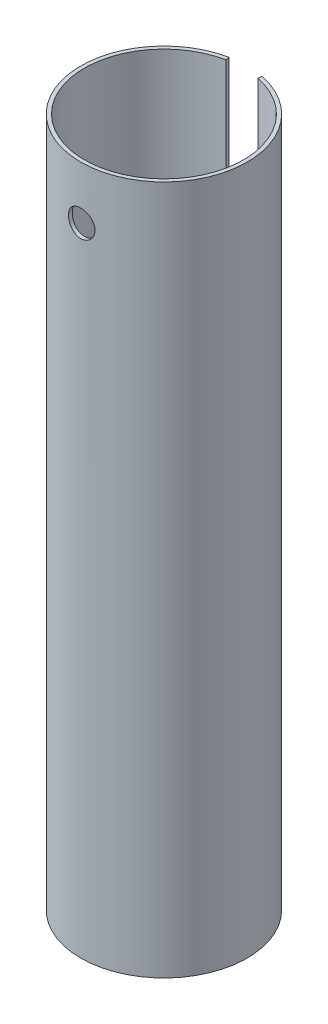
ISO-10303-21;
HEADER;
FILE_DESCRIPTION(('STEP AP214'),'2;1');
FILE_NAME('part.step','',(''),(''),'','','');
FILE_SCHEMA(('AUTOMOTIVE_DESIGN { 1 0 10303 214 1 1 1 1 }'));
ENDSEC;
DATA;
#1=APPLICATION_CONTEXT('core data for automotive mechanical design processes');
#2=APPLICATION_PROTOCOL_DEFINITION('international standard','automotive_design',2000,#1);
#3=PRODUCT_CONTEXT('',#1,'mechanical');
#4=PRODUCT('Part','Part','',(#3));
#5=PRODUCT_RELATED_PRODUCT_CATEGORY('part','',(#4));
#6=PRODUCT_DEFINITION_FORMATION('','',#4);
#7=PRODUCT_DEFINITION_CONTEXT('part definition',#1,'design');
#8=PRODUCT_DEFINITION('design','',#6,#7);
#9=PRODUCT_DEFINITION_SHAPE('','',#8);
#10=(LENGTH_UNIT() NAMED_UNIT(*) SI_UNIT(.MILLI.,.METRE.));
#11=(NAMED_UNIT(*) PLANE_ANGLE_UNIT() SI_UNIT($,.RADIAN.));
#12=(NAMED_UNIT(*) SI_UNIT($,.STERADIAN.) SOLID_ANGLE_UNIT());
#13=UNCERTAINTY_MEASURE_WITH_UNIT(LENGTH_MEASURE(1.E-05),#10,'distance_accuracy_value','');
#14=(GEOMETRIC_REPRESENTATION_CONTEXT(3) GLOBAL_UNCERTAINTY_ASSIGNED_CONTEXT((#13)) GLOBAL_UNIT_ASSIGNED_CONTEXT((#10,
#11,#12)) REPRESENTATION_CONTEXT('',''));
#15=CARTESIAN_POINT('',(0.,0.,0.));
#16=DIRECTION('',(0.,0.,1.));
#17=DIRECTION('',(1.,0.,0.));
#18=AXIS2_PLACEMENT_3D('',#15,#16,#17);
#19=CARTESIAN_POINT('',(0.,13.,0.));
#20=DIRECTION('',(0.,-1.,0.));
#21=DIRECTION('',(0.,0.,-1.));
#22=AXIS2_PLACEMENT_3D('',#19,#20,#21);
#23=CYLINDRICAL_SURFACE('',#22,1.5);
#24=CARTESIAN_POINT('',(0.,0.,0.));
#25=DIRECTION('',(0.,-1.,0.));
#26=DIRECTION('',(0.,0.,-1.));
#27=AXIS2_PLACEMENT_3D('',#24,#25,#26);
#28=CIRCLE('',#27,1.5);
#29=CARTESIAN_POINT('',(0.3,0.,-1.46969384566991));
#30=VERTEX_POINT('',#29);
#31=CARTESIAN_POINT('',(-0.3,0.,-1.46969384566991));
#32=VERTEX_POINT('',#31);
#33=EDGE_CURVE('E103',#30,#32,#28,.T.);
#34=ORIENTED_EDGE('',*,*,#33,.T.);
#35=DIRECTION('',(0.,-1.,0.));
#36=VECTOR('',#35,1.);
#37=CARTESIAN_POINT('',(-0.3,13.,-1.46969384566991));
#38=LINE('',#37,#36);
#39=CARTESIAN_POINT('',(-0.3,13.,-1.46969384566991));
#40=VERTEX_POINT('',#39);
#41=EDGE_CURVE('E44',#40,#32,#38,.T.);
#42=ORIENTED_EDGE('',*,*,#41,.F.);
#43=CARTESIAN_POINT('',(0.,13.,0.));
#44=DIRECTION('',(0.,-1.,0.));
#45=DIRECTION('',(0.,0.,-1.));
#46=AXIS2_PLACEMENT_3D('',#43,#44,#45);
#47=CIRCLE('',#46,1.5);
#48=CARTESIAN_POINT('',(0.3,13.,-1.46969384566991));
#49=VERTEX_POINT('',#48);
#50=EDGE_CURVE('E88',#49,#40,#47,.T.);
#51=ORIENTED_EDGE('',*,*,#50,.F.);
#52=DIRECTION('',(0.,-1.,0.));
#53=VECTOR('',#52,1.);
#54=CARTESIAN_POINT('',(0.3,13.,-1.46969384566991));
#55=LINE('',#54,#53);
#56=EDGE_CURVE('E99',#49,#30,#55,.T.);
#57=ORIENTED_EDGE('',*,*,#56,.T.);
#58=EDGE_LOOP('',(#34,#42,#51,#57));
#59=FACE_BOUND('',#58,.T.);
#60=CARTESIAN_POINT('',(-0.25,12.,1.4790199457749));
#61=CARTESIAN_POINT('',(-0.249999439842101,12.0139375748146,1.47902019740128));
#62=CARTESIAN_POINT('',(-0.248830516903732,12.0278827606025,1.47921909254807));
#63=CARTESIAN_POINT('',(-0.244187742807539,12.055381854322,1.47999245736818));
#64=CARTESIAN_POINT('',(-0.240711766030965,12.068935389375,1.48056727339143));
#65=CARTESIAN_POINT('',(-0.231562954366714,12.0952492283357,1.48202560932232));
#66=CARTESIAN_POINT('',(-0.225891955493109,12.1080101848666,1.48290887117195));
#67=CARTESIAN_POINT('',(-0.212518649689037,12.1323980954714,1.48488427211434));
#68=CARTESIAN_POINT('',(-0.204816571350157,12.1440251769576,1.48597638769747));
#69=CARTESIAN_POINT('',(-0.18751875269663,12.1659312849746,1.48825847115261));
#70=CARTESIAN_POINT('',(-0.177906904893227,12.1761975131387,1.48944921732707));
#71=CARTESIAN_POINT('',(-0.157097200469534,12.1949793306862,1.49178748066946));
#72=CARTESIAN_POINT('',(-0.145899249914999,12.2034948163115,1.49293499527197));
#73=CARTESIAN_POINT('',(-0.122152286994833,12.2185814567219,1.49506573698247));
#74=CARTESIAN_POINT('',(-0.10959560814567,12.2251407007732,1.49604794243228));
#75=CARTESIAN_POINT('',(-0.0835395621723865,12.2360521070531,1.49772873695715));
#76=CARTESIAN_POINT('',(-0.0700402564078183,12.2404044127885,1.49842734447267));
#77=CARTESIAN_POINT('',(-0.0426143726344235,12.2467392534984,1.49945673472438));
#78=CARTESIAN_POINT('',(-0.0286928886679263,12.2487432916005,1.4997908531109));
#79=CARTESIAN_POINT('',(-0.000707528552578904,12.2503915754153,1.50006507934278));
#80=CARTESIAN_POINT('',(0.0133563378528906,12.2500359815247,1.50000521396931));
#81=CARTESIAN_POINT('',(0.0410802185078885,12.2469918648472,1.49950085843139));
#82=CARTESIAN_POINT('',(0.0547428530700151,12.2443264836591,1.4990601836924));
#83=CARTESIAN_POINT('',(0.08142419796118,12.2367748925754,1.49784797877164));
#84=CARTESIAN_POINT('',(0.094442888665151,12.231888615041,1.49707643851321));
#85=CARTESIAN_POINT('',(0.119535614778266,12.2200109359685,1.49528269851196));
#86=CARTESIAN_POINT('',(0.131605052301906,12.2130099987918,1.49425936732688));
#87=CARTESIAN_POINT('',(0.154406552984665,12.1971087177365,1.4920757380715));
#88=CARTESIAN_POINT('',(0.165138507791588,12.1882082201289,1.49091542891913));
#89=CARTESIAN_POINT('',(0.185097127344667,12.1686321193381,1.4885702682326));
#90=CARTESIAN_POINT('',(0.194303950225321,12.1579362905099,1.48738528973104));
#91=CARTESIAN_POINT('',(0.210795458844807,12.1351412909784,1.48513795978481));
#92=CARTESIAN_POINT('',(0.218080126853242,12.1230421073317,1.48407560947132));
#93=CARTESIAN_POINT('',(0.230524443448829,12.0977608358123,1.48219375456182));
#94=CARTESIAN_POINT('',(0.235681702727925,12.0845775501908,1.4813745233026));
#95=CARTESIAN_POINT('',(0.243702987081562,12.0575150927692,1.48007618868988));
#96=CARTESIAN_POINT('',(0.246567214076796,12.0436359823568,1.47959705538832));
#97=CARTESIAN_POINT('',(0.249893188487927,12.0157533843838,1.47903895942212));
#98=CARTESIAN_POINT('',(0.250383220791244,12.0017533620298,1.47895528575867));
#99=CARTESIAN_POINT('',(0.249022270268246,11.9738713328309,1.47918503478236));
#100=CARTESIAN_POINT('',(0.247171377862466,11.9599893214486,1.47949844213185));
#101=CARTESIAN_POINT('',(0.241205233492809,11.9328272240809,1.48048268745502));
#102=CARTESIAN_POINT('',(0.237104379064638,11.9195438860122,1.48115125191835));
#103=CARTESIAN_POINT('',(0.226769819019227,11.893852983372,1.4827685730055));
#104=CARTESIAN_POINT('',(0.220535985810093,11.8814454712449,1.48371734639058));
#105=CARTESIAN_POINT('',(0.206045667322922,11.8577325405594,1.48579912839739));
#106=CARTESIAN_POINT('',(0.197771056415935,11.8464383427244,1.48693375560035));
#107=CARTESIAN_POINT('',(0.179458946570797,11.8253886467305,1.48925466667987));
#108=CARTESIAN_POINT('',(0.169421323638404,11.815633256889,1.49044095418533));
#109=CARTESIAN_POINT('',(0.147742807032881,11.7978348107271,1.49274642211826));
#110=CARTESIAN_POINT('',(0.136086325338619,11.7898106173715,1.49386477634467));
#111=CARTESIAN_POINT('',(0.111574344794932,11.7758344672995,1.49589511243294));
#112=CARTESIAN_POINT('',(0.0987188847470622,11.7698824435526,1.49680710096998));
#113=CARTESIAN_POINT('',(0.0722299051501322,11.7602489416045,1.49831835816958));
#114=CARTESIAN_POINT('',(0.0586000562602606,11.7565575924265,1.49891898456762));
#115=CARTESIAN_POINT('',(0.0309030734874208,11.7515184401036,1.49974558316928));
#116=CARTESIAN_POINT('',(0.016835975682162,11.7501704441268,1.49997158620018));
#117=CARTESIAN_POINT('',(-0.0111541275773687,11.7498618117688,1.50002303788783));
#118=CARTESIAN_POINT('',(-0.0250768160602688,11.7508724746059,1.49985330202424));
#119=CARTESIAN_POINT('',(-0.0525511974314699,11.7551903922269,1.49914217838728));
#120=CARTESIAN_POINT('',(-0.0661028923967432,11.758497634151,1.498600792695));
#121=CARTESIAN_POINT('',(-0.0924396445918597,11.7673038165544,1.49720698882758));
#122=CARTESIAN_POINT('',(-0.105225537215403,11.772800316821,1.49635491704155));
#123=CARTESIAN_POINT('',(-0.129698045298197,11.785825793623,1.49443275687735));
#124=CARTESIAN_POINT('',(-0.141384608611747,11.7933548665061,1.49336265816488));
#125=CARTESIAN_POINT('',(-0.163471294552717,11.8103335092462,1.49110762961897));
#126=CARTESIAN_POINT('',(-0.173855143060562,11.8198040954757,1.48992152455073));
#127=CARTESIAN_POINT('',(-0.192896387594805,11.8403528307898,1.48757630330475));
#128=CARTESIAN_POINT('',(-0.20155337867012,11.8514313558892,1.4864171935136));
#129=CARTESIAN_POINT('',(-0.216951427091962,11.8749745322508,1.4842483435701));
#130=CARTESIAN_POINT('',(-0.223678498909455,11.8874484339838,1.48323971798123));
#131=CARTESIAN_POINT('',(-0.234931453644092,11.9133609235911,1.48149921022177));
#132=CARTESIAN_POINT('',(-0.239459535523161,11.9267985322697,1.48076705175127));
#133=CARTESIAN_POINT('',(-0.245202605312214,11.9502403769477,1.47982474483778));
#134=CARTESIAN_POINT('',(-0.246998741767028,11.9601026807958,1.47952462342102));
#135=CARTESIAN_POINT('',(-0.249397629518242,11.9799753484841,1.47912213528652));
#136=CARTESIAN_POINT('',(-0.250000402479193,11.989985709633,1.47901976497878));
#137=CARTESIAN_POINT('',(-0.25,12.,1.4790199457749));
#138=B_SPLINE_CURVE_WITH_KNOTS('',3,(#60,#61,#62,#63,#64,#65,#66,#67,#68,#69,#70,#71,#72,#73,
#74,#75,#76,#77,#78,#79,#80,#81,#82,#83,#84,#85,#86,#87,#88,#89,#90,#91,#92,#93,#94,#95,#96,#97,
#98,#99,#100,#101,#102,#103,#104,#105,#106,#107,#108,#109,#110,#111,#112,#113,#114,#115,#116,
#117,#118,#119,#120,#121,#122,#123,#124,#125,#126,#127,#128,#129,#130,#131,#132,#133,#134,#135,
#136,#137),.UNSPECIFIED.,.T.,.F.,(4,2,2,2,2,2,2,2,2,2,2,2,2,2,2,2,2,2,2,2,2,2,2,2,2,2,2,2,2,2,2,
2,2,2,2,2,2,2,4),(0.,0.041776103890532,0.0835907519919456,0.125370499783167,0.167145547400922,
0.209289159151363,0.251435267830096,0.293832980107084,0.336227935106762,0.378231567468214,
0.420232344648341,0.461817121160318,0.503403164245182,0.545179604135075,0.586959426222413,
0.629246123457771,0.671533210741668,0.713867662494252,0.756198385933726,0.79802354241606,
0.839847083409626,0.881406064631143,0.922967532289226,0.964912342758353,1.00686010442634,
1.04924411303103,1.09162675047235,1.1338229844133,1.176015745908,1.21769777626157,
1.25937957321447,1.30101503982811,1.34265248038799,1.3847669974589,1.42689137887746,
1.46931372761285,1.51169356673763,1.54171067053694,1.57172722939499),.UNSPECIFIED.);
#139=CARTESIAN_POINT('',(-0.25,12.,1.4790199457749));
#140=VERTEX_POINT('',#139);
#141=EDGE_CURVE('E106',#140,#140,#138,.T.);
#142=ORIENTED_EDGE('',*,*,#141,.F.);
#143=EDGE_LOOP('',(#142));
#144=FACE_BOUND('',#143,.T.);
#145=ADVANCED_FACE('F31',(#59,#144),#23,.F.);
#146=CARTESIAN_POINT('',(0.,13.,0.));
#147=DIRECTION('',(0.,-1.,0.));
#148=DIRECTION('',(0.,0.,-1.));
#149=AXIS2_PLACEMENT_3D('',#146,#147,#148);
#150=CYLINDRICAL_SURFACE('',#149,1.57);
#151=CARTESIAN_POINT('',(0.,0.,0.));
#152=DIRECTION('',(0.,1.,0.));
#153=DIRECTION('',(0.,0.,-1.));
#154=AXIS2_PLACEMENT_3D('',#151,#152,#153);
#155=CIRCLE('',#154,1.57);
#156=CARTESIAN_POINT('',(-0.314000000000001,0.,-1.53827955846784));
#157=VERTEX_POINT('',#156);
#158=CARTESIAN_POINT('',(0.314000000000001,0.,-1.53827955846784));
#159=VERTEX_POINT('',#158);
#160=EDGE_CURVE('E69',#157,#159,#155,.T.);
#161=ORIENTED_EDGE('',*,*,#160,.T.);
#162=DIRECTION('',(0.,-1.,0.));
#163=VECTOR('',#162,1.);
#164=CARTESIAN_POINT('',(0.314000000000001,13.,-1.53827955846784));
#165=LINE('',#164,#163);
#166=CARTESIAN_POINT('',(0.314000000000001,13.,-1.53827955846784));
#167=VERTEX_POINT('',#166);
#168=EDGE_CURVE('E94',#167,#159,#165,.T.);
#169=ORIENTED_EDGE('',*,*,#168,.F.);
#170=CARTESIAN_POINT('',(0.,13.,0.));
#171=DIRECTION('',(0.,1.,0.));
#172=DIRECTION('',(0.,0.,-1.));
#173=AXIS2_PLACEMENT_3D('',#170,#171,#172);
#174=CIRCLE('',#173,1.57);
#175=CARTESIAN_POINT('',(-0.314000000000001,13.,-1.53827955846784));
#176=VERTEX_POINT('',#175);
#177=EDGE_CURVE('E86',#176,#167,#174,.T.);
#178=ORIENTED_EDGE('',*,*,#177,.F.);
#179=DIRECTION('',(0.,-1.,0.));
#180=VECTOR('',#179,1.);
#181=CARTESIAN_POINT('',(-0.314000000000001,13.,-1.53827955846784));
#182=LINE('',#181,#180);
#183=EDGE_CURVE('E91',#176,#157,#182,.T.);
#184=ORIENTED_EDGE('',*,*,#183,.T.);
#185=EDGE_LOOP('',(#161,#169,#178,#184));
#186=FACE_BOUND('',#185,.T.);
#187=CARTESIAN_POINT('',(0.,11.75,1.57));
#188=CARTESIAN_POINT('',(0.0139480288178817,11.7500005668594,1.569999767458));
#189=CARTESIAN_POINT('',(0.0279038908441007,11.7511712271632,1.56981218502685));
#190=CARTESIAN_POINT('',(0.0554248065915207,11.7558213401233,1.56908194015847));
#191=CARTESIAN_POINT('',(0.068989478602155,11.7593029731767,1.56853894239445));
#192=CARTESIAN_POINT('',(0.095325809555707,11.7684677538163,1.56715882462708));
#193=CARTESIAN_POINT('',(0.108098085448335,11.774149163079,1.56632193691207));
#194=CARTESIAN_POINT('',(0.132506265580401,11.78754780675,1.56444626693463));
#195=CARTESIAN_POINT('',(0.144142312251498,11.7952647855401,1.56340751002639));
#196=CARTESIAN_POINT('',(0.166051438774338,11.8125874763353,1.56123324487844));
#197=CARTESIAN_POINT('',(0.176313121451113,11.8222075174462,1.56009704214885));
#198=CARTESIAN_POINT('',(0.195083831658354,11.8430324144113,1.55786131283271));
#199=CARTESIAN_POINT('',(0.203592753162646,11.8542373660692,1.55676178846824));
#200=CARTESIAN_POINT('',(0.218661486300734,11.8779915318052,1.55471717843042));
#201=CARTESIAN_POINT('',(0.225210138031921,11.8905479092769,1.55377299030429));
#202=CARTESIAN_POINT('',(0.236101095776959,11.916599956782,1.5521555255852));
#203=CARTESIAN_POINT('',(0.240443537543262,11.9300955689644,1.55148223232408));
#204=CARTESIAN_POINT('',(0.246763132307242,11.957522604065,1.55048966629318));
#205=CARTESIAN_POINT('',(0.248759888472358,11.9714494020262,1.55016746110767));
#206=CARTESIAN_POINT('',(0.25039218797314,11.9994438189812,1.5499046679078));
#207=CARTESIAN_POINT('',(0.250027883905336,12.0135114288157,1.5499640552309));
#208=CARTESIAN_POINT('',(0.246964395643446,12.0412488750915,1.55045505771109));
#209=CARTESIAN_POINT('',(0.244287146154057,12.0549212050015,1.55088317591061));
#210=CARTESIAN_POINT('',(0.23670814776279,12.0816200972885,1.55205793335095));
#211=CARTESIAN_POINT('',(0.23180632866407,12.0946466392731,1.55280458264306));
#212=CARTESIAN_POINT('',(0.219894834253676,12.1197503365773,1.5545360904234));
#213=CARTESIAN_POINT('',(0.212875966997444,12.1318230560748,1.55552198395424));
#214=CARTESIAN_POINT('',(0.196936151419996,12.1546276859432,1.55762016308943));
#215=CARTESIAN_POINT('',(0.188015062699946,12.1653594972517,1.55873245802036));
#216=CARTESIAN_POINT('',(0.168404120998363,12.1853047150187,1.56097351733039));
#217=CARTESIAN_POINT('',(0.157695430253638,12.1944996045494,1.56210232584136));
#218=CARTESIAN_POINT('',(0.134877201002029,12.2109646422594,1.56423758778123));
#219=CARTESIAN_POINT('',(0.12276765486846,12.2182347799591,1.56524404054392));
#220=CARTESIAN_POINT('',(0.0974746737970485,12.2306452894779,1.56702244180814));
#221=CARTESIAN_POINT('',(0.0842904701748882,12.2357841205271,1.56779422055132));
#222=CARTESIAN_POINT('',(0.0572311338015513,12.243769458975,1.56901492819586));
#223=CARTESIAN_POINT('',(0.0433560538402837,12.2466161412323,1.56946388172398));
#224=CARTESIAN_POINT('',(0.0154685244390693,12.2499114932199,1.56998506548343));
#225=CARTESIAN_POINT('',(0.00145915276386207,12.2503855997612,1.57006129158891));
#226=CARTESIAN_POINT('',(-0.0264389337640737,12.2489900209313,1.5698393454603));
#227=CARTESIAN_POINT('',(-0.0403276528245431,12.2471204176296,1.56954118633605));
#228=CARTESIAN_POINT('',(-0.0675123118417604,12.2411116456484,1.56860644342153));
#229=CARTESIAN_POINT('',(-0.0808110846916626,12.2369849783768,1.5679717243526));
#230=CARTESIAN_POINT('',(-0.106528018785447,12.2265924804271,1.566434768169));
#231=CARTESIAN_POINT('',(-0.11894613417831,12.2203265384673,1.56553251713806));
#232=CARTESIAN_POINT('',(-0.142660363526558,12.2057744508241,1.56355074359986));
#233=CARTESIAN_POINT('',(-0.153946540181329,12.1974723028252,1.56246984017107));
#234=CARTESIAN_POINT('',(-0.17497454356252,12.1791056050133,1.5602550789941));
#235=CARTESIAN_POINT('',(-0.18471626837762,12.1690409389919,1.55912121775786));
#236=CARTESIAN_POINT('',(-0.202472333162538,12.1473212011245,1.55691552752175));
#237=CARTESIAN_POINT('',(-0.210469547753894,12.1356520488456,1.55584438299887));
#238=CARTESIAN_POINT('',(-0.224390237601662,12.1111210596603,1.5538978840182));
#239=CARTESIAN_POINT('',(-0.230313774297384,12.0982592581041,1.55302252375994));
#240=CARTESIAN_POINT('',(-0.239892920236883,12.0717574103352,1.551571759475));
#241=CARTESIAN_POINT('',(-0.243557276912953,12.0581205919834,1.55099519990795));
#242=CARTESIAN_POINT('',(-0.248541721594493,12.030415139071,1.55020433835804));
#243=CARTESIAN_POINT('',(-0.249861994022241,12.0163465385698,1.54999000787663));
#244=CARTESIAN_POINT('',(-0.25011599441291,11.988347736387,1.54994902565679));
#245=CARTESIAN_POINT('',(-0.249076664172278,11.9744177781214,1.55011799737946));
#246=CARTESIAN_POINT('',(-0.244698979660636,11.9469335501958,1.55081502575127));
#247=CARTESIAN_POINT('',(-0.241360631034976,11.9333792796134,1.55134308151865));
#248=CARTESIAN_POINT('',(-0.232489634522347,11.9070402517524,1.5526971769441));
#249=CARTESIAN_POINT('',(-0.226959106977124,11.8942547646052,1.55352292859208));
#250=CARTESIAN_POINT('',(-0.213863468074253,11.8697887620203,1.55537968448044));
#251=CARTESIAN_POINT('',(-0.206298270355831,11.858108293513,1.55641069743257));
#252=CARTESIAN_POINT('',(-0.189251087403263,11.8360474190391,1.55857577279469));
#253=CARTESIAN_POINT('',(-0.179749218211487,11.8256824737817,1.55971083087777));
#254=CARTESIAN_POINT('',(-0.159140413582449,11.8066848053342,1.56194799374738));
#255=CARTESIAN_POINT('',(-0.148033107167408,11.798052483616,1.56305009084619));
#256=CARTESIAN_POINT('',(-0.124446524321958,11.7827162452009,1.56510509301904));
#257=CARTESIAN_POINT('',(-0.111959104035048,11.7760247230627,1.56605702220594));
#258=CARTESIAN_POINT('',(-0.0860278074116853,11.7648443767362,1.56769491187139));
#259=CARTESIAN_POINT('',(-0.0725849170850748,11.7603533184813,1.56838114195731));
#260=CARTESIAN_POINT('',(-0.0492383399350721,11.7546964554294,1.56925739025935));
#261=CARTESIAN_POINT('',(-0.039477252007619,11.7529380455663,1.56953440729097));
#262=CARTESIAN_POINT('',(-0.019812092179168,11.750589625229,1.56990579339276));
#263=CARTESIAN_POINT('',(-0.00990802241279143,11.7499995973298,1.57000016518688));
#264=CARTESIAN_POINT('',(0.,11.75,1.57));
#265=B_SPLINE_CURVE_WITH_KNOTS('',3,(#187,#188,#189,#190,#191,#192,#193,#194,#195,#196,#197,
#198,#199,#200,#201,#202,#203,#204,#205,#206,#207,#208,#209,#210,#211,#212,#213,#214,#215,#216,
#217,#218,#219,#220,#221,#222,#223,#224,#225,#226,#227,#228,#229,#230,#231,#232,#233,#234,#235,
#236,#237,#238,#239,#240,#241,#242,#243,#244,#245,#246,#247,#248,#249,#250,#251,#252,#253,#254,
#255,#256,#257,#258,#259,#260,#261,#262,#263,#264),.UNSPECIFIED.,.T.,.F.,(4,2,2,2,2,2,2,2,2,2,2,
2,2,2,2,2,2,2,2,2,2,2,2,2,2,2,2,2,2,2,2,2,2,2,2,2,2,2,4),(0.,0.0418078751889797,
0.0836552521842597,0.125469627506183,0.167278754453016,0.209415564814871,0.251554923324017,
0.293929809736974,0.336302088423695,0.37831767941575,0.420330554945736,0.461949323221531,
0.503569404879142,0.545372862364752,0.587179406341412,0.629458093794674,0.671737011436893,
0.714046440414711,0.75635264147239,0.798204283576478,0.840054460203906,0.881675150849133,
0.923298006867704,0.965259087871174,1.00722293654329,1.0495818423915,1.09193949311602,
1.13413208985102,1.17632136691025,1.21803135530698,1.25974124128319,1.30141088225694,
1.34308229216136,1.38520529971012,1.42733805647642,1.46973424284795,1.51208729595718,
1.54178608334459,1.57148442780689),.UNSPECIFIED.);
#266=CARTESIAN_POINT('',(0.,11.75,1.57));
#267=VERTEX_POINT('',#266);
#268=EDGE_CURVE('E11',#267,#267,#265,.T.);
#269=ORIENTED_EDGE('',*,*,#268,.F.);
#270=EDGE_LOOP('',(#269));
#271=FACE_BOUND('',#270,.T.);
#272=ADVANCED_FACE('F96',(#186,#271),#150,.T.);
#273=CARTESIAN_POINT('',(-0.314,13.,-1.53827955846784));
#274=DIRECTION('',(-0.979795897113271,0.,0.200000000000001));
#275=DIRECTION('',(0.200000000000001,0.,0.979795897113271));
#276=AXIS2_PLACEMENT_3D('',#273,#274,#275);
#277=PLANE('',#276);
#278=DIRECTION('',(-0.200000000000001,0.,-0.979795897113271));
#279=VECTOR('',#278,1.);
#280=CARTESIAN_POINT('',(-0.314,0.,-1.53827955846784));
#281=LINE('',#280,#279);
#282=EDGE_CURVE('E93',#32,#157,#281,.T.);
#283=ORIENTED_EDGE('',*,*,#282,.T.);
#284=ORIENTED_EDGE('',*,*,#183,.F.);
#285=DIRECTION('',(-0.200000000000001,0.,-0.979795897113271));
#286=VECTOR('',#285,1.);
#287=CARTESIAN_POINT('',(-0.314,13.,-1.53827955846784));
#288=LINE('',#287,#286);
#289=EDGE_CURVE('E83',#40,#176,#288,.T.);
#290=ORIENTED_EDGE('',*,*,#289,.F.);
#291=ORIENTED_EDGE('',*,*,#41,.T.);
#292=EDGE_LOOP('',(#283,#284,#290,#291));
#293=FACE_BOUND('',#292,.T.);
#294=ADVANCED_FACE('F92',(#293),#277,.F.);
#295=CARTESIAN_POINT('',(0.314000000000001,13.,-1.53827955846784));
#296=DIRECTION('',(0.97979589711327,0.,0.200000000000009));
#297=DIRECTION('',(0.200000000000009,0.,-0.97979589711327));
#298=AXIS2_PLACEMENT_3D('',#295,#296,#297);
#299=PLANE('',#298);
#300=DIRECTION('',(-0.200000000000009,0.,0.97979589711327));
#301=VECTOR('',#300,1.);
#302=CARTESIAN_POINT('',(0.314000000000001,0.,-1.53827955846784));
#303=LINE('',#302,#301);
#304=EDGE_CURVE('E75',#159,#30,#303,.T.);
#305=ORIENTED_EDGE('',*,*,#304,.T.);
#306=ORIENTED_EDGE('',*,*,#56,.F.);
#307=DIRECTION('',(-0.200000000000009,0.,0.97979589711327));
#308=VECTOR('',#307,1.);
#309=CARTESIAN_POINT('',(0.314000000000001,13.,-1.53827955846784));
#310=LINE('',#309,#308);
#311=EDGE_CURVE('E52',#167,#49,#310,.T.);
#312=ORIENTED_EDGE('',*,*,#311,.F.);
#313=ORIENTED_EDGE('',*,*,#168,.T.);
#314=EDGE_LOOP('',(#305,#306,#312,#313));
#315=FACE_BOUND('',#314,.T.);
#316=ADVANCED_FACE('F124',(#315),#299,.F.);
#317=CARTESIAN_POINT('',(0.,13.,0.));
#318=DIRECTION('',(0.,-1.,0.));
#319=DIRECTION('',(0.,0.,-1.));
#320=AXIS2_PLACEMENT_3D('',#317,#318,#319);
#321=PLANE('',#320);
#322=ORIENTED_EDGE('',*,*,#50,.T.);
#323=ORIENTED_EDGE('',*,*,#289,.T.);
#324=ORIENTED_EDGE('',*,*,#177,.T.);
#325=ORIENTED_EDGE('',*,*,#311,.T.);
#326=EDGE_LOOP('',(#322,#323,#324,#325));
#327=FACE_BOUND('',#326,.T.);
#328=ADVANCED_FACE('F84',(#327),#321,.F.);
#329=CARTESIAN_POINT('',(0.,0.,0.));
#330=DIRECTION('',(0.,-1.,0.));
#331=DIRECTION('',(0.,0.,-1.));
#332=AXIS2_PLACEMENT_3D('',#329,#330,#331);
#333=PLANE('',#332);
#334=ORIENTED_EDGE('',*,*,#33,.F.);
#335=ORIENTED_EDGE('',*,*,#304,.F.);
#336=ORIENTED_EDGE('',*,*,#160,.F.);
#337=ORIENTED_EDGE('',*,*,#282,.F.);
#338=EDGE_LOOP('',(#334,#335,#336,#337));
#339=FACE_BOUND('',#338,.T.);
#340=ADVANCED_FACE('F115',(#339),#333,.T.);
#341=CARTESIAN_POINT('',(0.,12.,1.57));
#342=DIRECTION('',(0.,0.,-1.));
#343=DIRECTION('',(-1.,0.,0.));
#344=AXIS2_PLACEMENT_3D('',#341,#342,#343);
#345=CYLINDRICAL_SURFACE('',#344,0.25);
#346=ORIENTED_EDGE('',*,*,#268,.T.);
#347=EDGE_LOOP('',(#346));
#348=FACE_BOUND('',#347,.T.);
#349=ORIENTED_EDGE('',*,*,#141,.T.);
#350=EDGE_LOOP('',(#349));
#351=FACE_BOUND('',#350,.T.);
#352=ADVANCED_FACE('F117',(#348,#351),#345,.F.);
#353=CLOSED_SHELL('',(#145,#272,#294,#316,#328,#340,#352));
#354=MANIFOLD_SOLID_BREP('B2',#353);
#355=ADVANCED_BREP_SHAPE_REPRESENTATION('',(#18,#354),#14);
#356=SHAPE_DEFINITION_REPRESENTATION(#9,#355);
ENDSEC;
END-ISO-10303-21;
